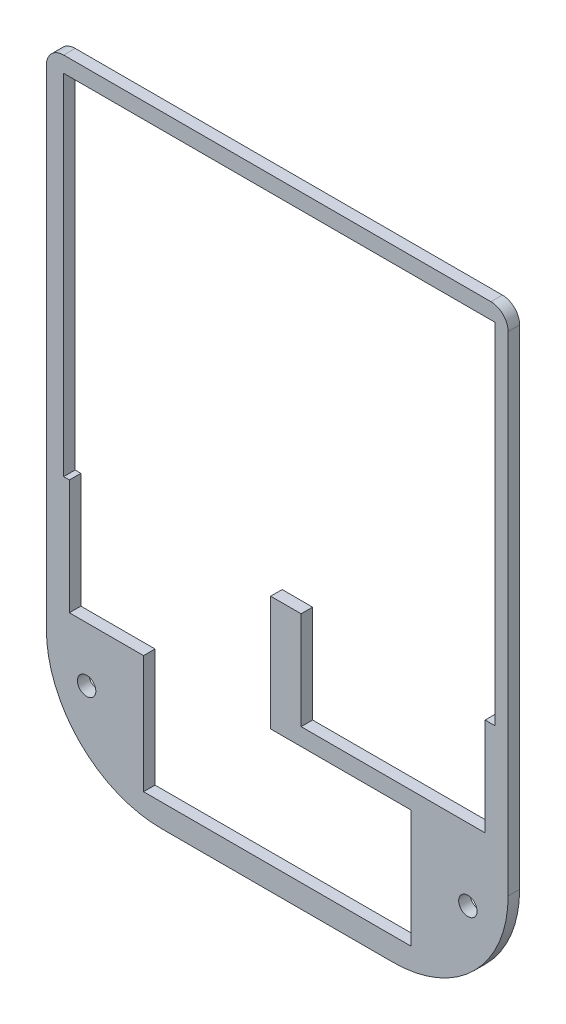
ISO-10303-21;
HEADER;
FILE_DESCRIPTION(('STEP AP214'),'2;1');
FILE_NAME('part.step','',(''),(''),'','','');
FILE_SCHEMA(('AUTOMOTIVE_DESIGN { 1 0 10303 214 1 1 1 1 }'));
ENDSEC;
DATA;
#1=APPLICATION_CONTEXT('core data for automotive mechanical design processes');
#2=APPLICATION_PROTOCOL_DEFINITION('international standard','automotive_design',2000,#1);
#3=PRODUCT_CONTEXT('',#1,'mechanical');
#4=PRODUCT('Part','Part','',(#3));
#5=PRODUCT_RELATED_PRODUCT_CATEGORY('part','',(#4));
#6=PRODUCT_DEFINITION_FORMATION('','',#4);
#7=PRODUCT_DEFINITION_CONTEXT('part definition',#1,'design');
#8=PRODUCT_DEFINITION('design','',#6,#7);
#9=PRODUCT_DEFINITION_SHAPE('','',#8);
#10=(LENGTH_UNIT() NAMED_UNIT(*) SI_UNIT(.MILLI.,.METRE.));
#11=(NAMED_UNIT(*) PLANE_ANGLE_UNIT() SI_UNIT($,.RADIAN.));
#12=(NAMED_UNIT(*) SI_UNIT($,.STERADIAN.) SOLID_ANGLE_UNIT());
#13=UNCERTAINTY_MEASURE_WITH_UNIT(LENGTH_MEASURE(1.E-05),#10,'distance_accuracy_value','');
#14=(GEOMETRIC_REPRESENTATION_CONTEXT(3) GLOBAL_UNCERTAINTY_ASSIGNED_CONTEXT((#13)) GLOBAL_UNIT_ASSIGNED_CONTEXT((#10,
#11,#12)) REPRESENTATION_CONTEXT('',''));
#15=CARTESIAN_POINT('',(0.,0.,0.));
#16=DIRECTION('',(0.,0.,1.));
#17=DIRECTION('',(1.,0.,0.));
#18=AXIS2_PLACEMENT_3D('',#15,#16,#17);
#19=CARTESIAN_POINT('',(0.,0.,2.));
#20=DIRECTION('',(0.,0.,-1.));
#21=DIRECTION('',(-1.,0.,0.));
#22=AXIS2_PLACEMENT_3D('',#19,#20,#21);
#23=PLANE('',#22);
#24=CARTESIAN_POINT('',(7.,-27.,2.));
#25=DIRECTION('',(0.,0.,1.));
#26=DIRECTION('',(1.,0.,0.));
#27=AXIS2_PLACEMENT_3D('',#24,#25,#26);
#28=CIRCLE('',#27,1.59999999999999);
#29=CARTESIAN_POINT('',(8.59999999999999,-27.,2.));
#30=VERTEX_POINT('',#29);
#31=EDGE_CURVE('E376',#30,#30,#28,.T.);
#32=ORIENTED_EDGE('',*,*,#31,.F.);
#33=EDGE_LOOP('',(#32));
#34=FACE_BOUND('',#33,.T.);
#35=CARTESIAN_POINT('',(73.3,-27.,2.));
#36=DIRECTION('',(0.,0.,1.));
#37=DIRECTION('',(1.,0.,0.));
#38=AXIS2_PLACEMENT_3D('',#35,#36,#37);
#39=CIRCLE('',#38,1.59999999999999);
#40=CARTESIAN_POINT('',(74.9,-27.,2.));
#41=VERTEX_POINT('',#40);
#42=EDGE_CURVE('E380',#41,#41,#39,.T.);
#43=ORIENTED_EDGE('',*,*,#42,.F.);
#44=EDGE_LOOP('',(#43));
#45=FACE_BOUND('',#44,.T.);
#46=DIRECTION('',(0.,-1.,0.));
#47=VECTOR('',#46,1.);
#48=CARTESIAN_POINT('',(0.,0.,2.));
#49=LINE('',#48,#47);
#50=CARTESIAN_POINT('',(0.,63.,2.));
#51=VERTEX_POINT('',#50);
#52=CARTESIAN_POINT('',(0.,-22.,2.));
#53=VERTEX_POINT('',#52);
#54=EDGE_CURVE('E391',#51,#53,#49,.T.);
#55=ORIENTED_EDGE('',*,*,#54,.T.);
#56=CARTESIAN_POINT('',(20.,-22.,2.));
#57=DIRECTION('',(0.,0.,-1.));
#58=DIRECTION('',(-1.,0.,0.));
#59=AXIS2_PLACEMENT_3D('',#56,#57,#58);
#60=CIRCLE('',#59,20.);
#61=CARTESIAN_POINT('',(20.,-42.,2.));
#62=VERTEX_POINT('',#61);
#63=EDGE_CURVE('E78',#53,#62,#60,.F.);
#64=ORIENTED_EDGE('',*,*,#63,.T.);
#65=DIRECTION('',(-1.,0.,0.));
#66=VECTOR('',#65,1.);
#67=CARTESIAN_POINT('',(80.3,-42.,2.));
#68=LINE('',#67,#66);
#69=CARTESIAN_POINT('',(60.3,-42.,2.));
#70=VERTEX_POINT('',#69);
#71=EDGE_CURVE('E387',#70,#62,#68,.T.);
#72=ORIENTED_EDGE('',*,*,#71,.F.);
#73=CARTESIAN_POINT('',(60.3,-22.,2.));
#74=DIRECTION('',(0.,0.,-1.));
#75=DIRECTION('',(-1.,0.,0.));
#76=AXIS2_PLACEMENT_3D('',#73,#74,#75);
#77=CIRCLE('',#76,20.);
#78=CARTESIAN_POINT('',(80.3,-22.,2.));
#79=VERTEX_POINT('',#78);
#80=EDGE_CURVE('E86',#70,#79,#77,.F.);
#81=ORIENTED_EDGE('',*,*,#80,.T.);
#82=DIRECTION('',(0.,1.,0.));
#83=VECTOR('',#82,1.);
#84=CARTESIAN_POINT('',(80.3,0.,2.));
#85=LINE('',#84,#83);
#86=CARTESIAN_POINT('',(80.3,63.,2.));
#87=VERTEX_POINT('',#86);
#88=EDGE_CURVE('E393',#79,#87,#85,.T.);
#89=ORIENTED_EDGE('',*,*,#88,.T.);
#90=CARTESIAN_POINT('',(77.3,63.,2.));
#91=DIRECTION('',(0.,0.,-1.));
#92=DIRECTION('',(-1.,0.,0.));
#93=AXIS2_PLACEMENT_3D('',#90,#91,#92);
#94=CIRCLE('',#93,3.);
#95=CARTESIAN_POINT('',(77.3,66.,2.));
#96=VERTEX_POINT('',#95);
#97=EDGE_CURVE('E419',#87,#96,#94,.F.);
#98=ORIENTED_EDGE('',*,*,#97,.T.);
#99=DIRECTION('',(-1.,0.,0.));
#100=VECTOR('',#99,1.);
#101=CARTESIAN_POINT('',(0.,66.,2.));
#102=LINE('',#101,#100);
#103=CARTESIAN_POINT('',(3.,66.,2.));
#104=VERTEX_POINT('',#103);
#105=EDGE_CURVE('E396',#96,#104,#102,.T.);
#106=ORIENTED_EDGE('',*,*,#105,.T.);
#107=CARTESIAN_POINT('',(3.,63.,2.));
#108=DIRECTION('',(0.,0.,-1.));
#109=DIRECTION('',(-1.,0.,0.));
#110=AXIS2_PLACEMENT_3D('',#107,#108,#109);
#111=CIRCLE('',#110,3.);
#112=EDGE_CURVE('E417',#104,#51,#111,.F.);
#113=ORIENTED_EDGE('',*,*,#112,.T.);
#114=EDGE_LOOP('',(#55,#64,#72,#81,#89,#98,#106,#113));
#115=FACE_BOUND('',#114,.T.);
#116=DIRECTION('',(0.,1.,0.));
#117=VECTOR('',#116,1.);
#118=CARTESIAN_POINT('',(78.,63.25,2.));
#119=LINE('',#118,#117);
#120=CARTESIAN_POINT('',(78.,2.50000000000001,2.));
#121=VERTEX_POINT('',#120);
#122=CARTESIAN_POINT('',(78.,63.25,2.));
#123=VERTEX_POINT('',#122);
#124=EDGE_CURVE('E286',#121,#123,#119,.T.);
#125=ORIENTED_EDGE('',*,*,#124,.F.);
#126=DIRECTION('',(1.,0.,0.));
#127=VECTOR('',#126,1.);
#128=CARTESIAN_POINT('',(3.00000000000001,2.50000000000001,2.));
#129=LINE('',#128,#127);
#130=CARTESIAN_POINT('',(76.3,2.50000000000001,2.));
#131=VERTEX_POINT('',#130);
#132=EDGE_CURVE('E270',#131,#121,#129,.T.);
#133=ORIENTED_EDGE('',*,*,#132,.F.);
#134=DIRECTION('',(0.,-1.,0.));
#135=VECTOR('',#134,1.);
#136=CARTESIAN_POINT('',(76.3,0.,2.));
#137=LINE('',#136,#135);
#138=CARTESIAN_POINT('',(76.3,-14.5,2.));
#139=VERTEX_POINT('',#138);
#140=EDGE_CURVE('E288',#131,#139,#137,.T.);
#141=ORIENTED_EDGE('',*,*,#140,.T.);
#142=DIRECTION('',(1.,0.,0.));
#143=VECTOR('',#142,1.);
#144=CARTESIAN_POINT('',(0.,-14.5,2.));
#145=LINE('',#144,#143);
#146=CARTESIAN_POINT('',(44.3,-14.5,2.));
#147=VERTEX_POINT('',#146);
#148=EDGE_CURVE('E295',#147,#139,#145,.T.);
#149=ORIENTED_EDGE('',*,*,#148,.F.);
#150=DIRECTION('',(0.,-1.,0.));
#151=VECTOR('',#150,1.);
#152=CARTESIAN_POINT('',(44.3,0.,2.));
#153=LINE('',#152,#151);
#154=CARTESIAN_POINT('',(44.3,2.5,2.));
#155=VERTEX_POINT('',#154);
#156=EDGE_CURVE('E289',#155,#147,#153,.T.);
#157=ORIENTED_EDGE('',*,*,#156,.F.);
#158=CARTESIAN_POINT('',(39.,2.50000000000001,2.));
#159=VERTEX_POINT('',#158);
#160=EDGE_CURVE('E269',#159,#155,#129,.T.);
#161=ORIENTED_EDGE('',*,*,#160,.F.);
#162=DIRECTION('',(0.,-1.,0.));
#163=VECTOR('',#162,1.);
#164=CARTESIAN_POINT('',(39.,0.,2.));
#165=LINE('',#164,#163);
#166=CARTESIAN_POINT('',(39.,-17.5,2.));
#167=VERTEX_POINT('',#166);
#168=EDGE_CURVE('E307',#159,#167,#165,.T.);
#169=ORIENTED_EDGE('',*,*,#168,.T.);
#170=DIRECTION('',(1.,0.,0.));
#171=VECTOR('',#170,1.);
#172=CARTESIAN_POINT('',(0.,-17.5,2.));
#173=LINE('',#172,#171);
#174=CARTESIAN_POINT('',(63.4,-17.5,2.));
#175=VERTEX_POINT('',#174);
#176=EDGE_CURVE('E317',#167,#175,#173,.T.);
#177=ORIENTED_EDGE('',*,*,#176,.T.);
#178=DIRECTION('',(0.,-1.,0.));
#179=VECTOR('',#178,1.);
#180=CARTESIAN_POINT('',(63.4,0.,2.));
#181=LINE('',#180,#179);
#182=CARTESIAN_POINT('',(63.4,-38.,2.));
#183=VERTEX_POINT('',#182);
#184=EDGE_CURVE('E347',#175,#183,#181,.T.);
#185=ORIENTED_EDGE('',*,*,#184,.T.);
#186=DIRECTION('',(1.,0.,0.));
#187=VECTOR('',#186,1.);
#188=CARTESIAN_POINT('',(0.,-38.,2.));
#189=LINE('',#188,#187);
#190=CARTESIAN_POINT('',(16.9,-38.,2.));
#191=VERTEX_POINT('',#190);
#192=EDGE_CURVE('E344',#191,#183,#189,.T.);
#193=ORIENTED_EDGE('',*,*,#192,.F.);
#194=DIRECTION('',(0.,-1.,0.));
#195=VECTOR('',#194,1.);
#196=CARTESIAN_POINT('',(16.9,0.,2.));
#197=LINE('',#196,#195);
#198=CARTESIAN_POINT('',(16.9,-17.5,2.));
#199=VERTEX_POINT('',#198);
#200=EDGE_CURVE('E341',#199,#191,#197,.T.);
#201=ORIENTED_EDGE('',*,*,#200,.F.);
#202=DIRECTION('',(1.,0.,0.));
#203=VECTOR('',#202,1.);
#204=CARTESIAN_POINT('',(0.,-17.5,2.));
#205=LINE('',#204,#203);
#206=CARTESIAN_POINT('',(4.,-17.5,2.));
#207=VERTEX_POINT('',#206);
#208=EDGE_CURVE('E338',#207,#199,#205,.T.);
#209=ORIENTED_EDGE('',*,*,#208,.F.);
#210=DIRECTION('',(0.,-1.,0.));
#211=VECTOR('',#210,1.);
#212=CARTESIAN_POINT('',(4.,0.,2.));
#213=LINE('',#212,#211);
#214=CARTESIAN_POINT('',(4.,2.5,2.));
#215=VERTEX_POINT('',#214);
#216=EDGE_CURVE('E335',#215,#207,#213,.T.);
#217=ORIENTED_EDGE('',*,*,#216,.F.);
#218=CARTESIAN_POINT('',(3.00000000000001,2.50000000000001,2.));
#219=VERTEX_POINT('',#218);
#220=EDGE_CURVE('E267',#219,#215,#129,.T.);
#221=ORIENTED_EDGE('',*,*,#220,.F.);
#222=DIRECTION('',(0.,-1.,0.));
#223=VECTOR('',#222,1.);
#224=CARTESIAN_POINT('',(3.00000000000001,63.25,2.));
#225=LINE('',#224,#223);
#226=CARTESIAN_POINT('',(3.00000000000001,63.25,2.));
#227=VERTEX_POINT('',#226);
#228=EDGE_CURVE('E254',#227,#219,#225,.T.);
#229=ORIENTED_EDGE('',*,*,#228,.F.);
#230=DIRECTION('',(-1.,0.,0.));
#231=VECTOR('',#230,1.);
#232=CARTESIAN_POINT('',(3.00000000000001,63.25,2.));
#233=LINE('',#232,#231);
#234=EDGE_CURVE('E248',#123,#227,#233,.T.);
#235=ORIENTED_EDGE('',*,*,#234,.F.);
#236=EDGE_LOOP('',(#125,#133,#141,#149,#157,#161,#169,#177,#185,#193,#201,#209,#217,#221,#229,#235));
#237=FACE_BOUND('',#236,.T.);
#238=ADVANCED_FACE('F69',(#34,#45,#115,#237),#23,.F.);
#239=CARTESIAN_POINT('',(0.,0.,0.));
#240=DIRECTION('',(0.,0.,-1.));
#241=DIRECTION('',(-1.,0.,0.));
#242=AXIS2_PLACEMENT_3D('',#239,#240,#241);
#243=PLANE('',#242);
#244=DIRECTION('',(1.,0.,0.));
#245=VECTOR('',#244,1.);
#246=CARTESIAN_POINT('',(3.00000000000001,2.50000000000001,0.));
#247=LINE('',#246,#245);
#248=CARTESIAN_POINT('',(76.3,2.50000000000001,0.));
#249=VERTEX_POINT('',#248);
#250=CARTESIAN_POINT('',(78.,2.50000000000001,0.));
#251=VERTEX_POINT('',#250);
#252=EDGE_CURVE('E264',#249,#251,#247,.T.);
#253=ORIENTED_EDGE('',*,*,#252,.T.);
#254=DIRECTION('',(0.,1.,0.));
#255=VECTOR('',#254,1.);
#256=CARTESIAN_POINT('',(78.,63.25,0.));
#257=LINE('',#256,#255);
#258=CARTESIAN_POINT('',(78.,63.25,0.));
#259=VERTEX_POINT('',#258);
#260=EDGE_CURVE('E247',#251,#259,#257,.T.);
#261=ORIENTED_EDGE('',*,*,#260,.T.);
#262=DIRECTION('',(-1.,0.,0.));
#263=VECTOR('',#262,1.);
#264=CARTESIAN_POINT('',(3.00000000000001,63.25,0.));
#265=LINE('',#264,#263);
#266=CARTESIAN_POINT('',(3.00000000000001,63.25,0.));
#267=VERTEX_POINT('',#266);
#268=EDGE_CURVE('E245',#259,#267,#265,.T.);
#269=ORIENTED_EDGE('',*,*,#268,.T.);
#270=DIRECTION('',(0.,-1.,0.));
#271=VECTOR('',#270,1.);
#272=CARTESIAN_POINT('',(3.00000000000001,63.25,0.));
#273=LINE('',#272,#271);
#274=CARTESIAN_POINT('',(3.00000000000001,2.50000000000001,0.));
#275=VERTEX_POINT('',#274);
#276=EDGE_CURVE('E234',#267,#275,#273,.T.);
#277=ORIENTED_EDGE('',*,*,#276,.T.);
#278=CARTESIAN_POINT('',(4.,2.50000000000001,0.));
#279=VERTEX_POINT('',#278);
#280=EDGE_CURVE('E241',#275,#279,#247,.T.);
#281=ORIENTED_EDGE('',*,*,#280,.T.);
#282=DIRECTION('',(0.,-1.,0.));
#283=VECTOR('',#282,1.);
#284=CARTESIAN_POINT('',(4.,0.,0.));
#285=LINE('',#284,#283);
#286=CARTESIAN_POINT('',(4.,-17.5,0.));
#287=VERTEX_POINT('',#286);
#288=EDGE_CURVE('E316',#279,#287,#285,.T.);
#289=ORIENTED_EDGE('',*,*,#288,.T.);
#290=DIRECTION('',(1.,0.,0.));
#291=VECTOR('',#290,1.);
#292=CARTESIAN_POINT('',(0.,-17.5,0.));
#293=LINE('',#292,#291);
#294=CARTESIAN_POINT('',(16.9,-17.5,0.));
#295=VERTEX_POINT('',#294);
#296=EDGE_CURVE('E319',#287,#295,#293,.T.);
#297=ORIENTED_EDGE('',*,*,#296,.T.);
#298=DIRECTION('',(0.,-1.,0.));
#299=VECTOR('',#298,1.);
#300=CARTESIAN_POINT('',(16.9,0.,0.));
#301=LINE('',#300,#299);
#302=CARTESIAN_POINT('',(16.9,-38.,0.));
#303=VERTEX_POINT('',#302);
#304=EDGE_CURVE('E322',#295,#303,#301,.T.);
#305=ORIENTED_EDGE('',*,*,#304,.T.);
#306=DIRECTION('',(1.,0.,0.));
#307=VECTOR('',#306,1.);
#308=CARTESIAN_POINT('',(0.,-38.,0.));
#309=LINE('',#308,#307);
#310=CARTESIAN_POINT('',(63.4,-38.,0.));
#311=VERTEX_POINT('',#310);
#312=EDGE_CURVE('E325',#303,#311,#309,.T.);
#313=ORIENTED_EDGE('',*,*,#312,.T.);
#314=DIRECTION('',(0.,-1.,0.));
#315=VECTOR('',#314,1.);
#316=CARTESIAN_POINT('',(63.4,0.,0.));
#317=LINE('',#316,#315);
#318=CARTESIAN_POINT('',(63.4,-17.5,0.));
#319=VERTEX_POINT('',#318);
#320=EDGE_CURVE('E328',#319,#311,#317,.T.);
#321=ORIENTED_EDGE('',*,*,#320,.F.);
#322=DIRECTION('',(1.,0.,0.));
#323=VECTOR('',#322,1.);
#324=CARTESIAN_POINT('',(0.,-17.5,0.));
#325=LINE('',#324,#323);
#326=CARTESIAN_POINT('',(39.,-17.5,0.));
#327=VERTEX_POINT('',#326);
#328=EDGE_CURVE('E330',#327,#319,#325,.T.);
#329=ORIENTED_EDGE('',*,*,#328,.F.);
#330=DIRECTION('',(0.,-1.,0.));
#331=VECTOR('',#330,1.);
#332=CARTESIAN_POINT('',(39.,0.,0.));
#333=LINE('',#332,#331);
#334=CARTESIAN_POINT('',(39.,2.50000000000001,0.));
#335=VERTEX_POINT('',#334);
#336=EDGE_CURVE('E314',#335,#327,#333,.T.);
#337=ORIENTED_EDGE('',*,*,#336,.F.);
#338=CARTESIAN_POINT('',(44.3,2.50000000000001,0.));
#339=VERTEX_POINT('',#338);
#340=EDGE_CURVE('E262',#335,#339,#247,.T.);
#341=ORIENTED_EDGE('',*,*,#340,.T.);
#342=DIRECTION('',(0.,-1.,0.));
#343=VECTOR('',#342,1.);
#344=CARTESIAN_POINT('',(44.3,0.,0.));
#345=LINE('',#344,#343);
#346=CARTESIAN_POINT('',(44.3,-14.5,0.));
#347=VERTEX_POINT('',#346);
#348=EDGE_CURVE('E294',#339,#347,#345,.T.);
#349=ORIENTED_EDGE('',*,*,#348,.T.);
#350=DIRECTION('',(1.,0.,0.));
#351=VECTOR('',#350,1.);
#352=CARTESIAN_POINT('',(0.,-14.5,0.));
#353=LINE('',#352,#351);
#354=CARTESIAN_POINT('',(76.3,-14.5,0.));
#355=VERTEX_POINT('',#354);
#356=EDGE_CURVE('E298',#347,#355,#353,.T.);
#357=ORIENTED_EDGE('',*,*,#356,.T.);
#358=DIRECTION('',(0.,-1.,0.));
#359=VECTOR('',#358,1.);
#360=CARTESIAN_POINT('',(76.3,0.,0.));
#361=LINE('',#360,#359);
#362=EDGE_CURVE('E292',#249,#355,#361,.T.);
#363=ORIENTED_EDGE('',*,*,#362,.F.);
#364=EDGE_LOOP('',(#253,#261,#269,#277,#281,#289,#297,#305,#313,#321,#329,#337,#341,#349,#357,#363));
#365=FACE_BOUND('',#364,.T.);
#366=CARTESIAN_POINT('',(7.,-27.,0.));
#367=DIRECTION('',(0.,0.,-1.));
#368=DIRECTION('',(-1.,0.,0.));
#369=AXIS2_PLACEMENT_3D('',#366,#367,#368);
#370=CIRCLE('',#369,1.59999999999999);
#371=CARTESIAN_POINT('',(5.40000000000002,-27.,0.));
#372=VERTEX_POINT('',#371);
#373=EDGE_CURVE('E73',#372,#372,#370,.T.);
#374=ORIENTED_EDGE('',*,*,#373,.F.);
#375=EDGE_LOOP('',(#374));
#376=FACE_BOUND('',#375,.T.);
#377=CARTESIAN_POINT('',(73.3,-27.,0.));
#378=DIRECTION('',(0.,0.,-1.));
#379=DIRECTION('',(-1.,0.,0.));
#380=AXIS2_PLACEMENT_3D('',#377,#378,#379);
#381=CIRCLE('',#380,1.59999999999998);
#382=CARTESIAN_POINT('',(71.7,-27.,0.));
#383=VERTEX_POINT('',#382);
#384=EDGE_CURVE('E383',#383,#383,#381,.T.);
#385=ORIENTED_EDGE('',*,*,#384,.F.);
#386=EDGE_LOOP('',(#385));
#387=FACE_BOUND('',#386,.T.);
#388=DIRECTION('',(1.,0.,0.));
#389=VECTOR('',#388,1.);
#390=CARTESIAN_POINT('',(0.,-42.,0.));
#391=LINE('',#390,#389);
#392=CARTESIAN_POINT('',(20.,-42.,0.));
#393=VERTEX_POINT('',#392);
#394=CARTESIAN_POINT('',(60.3,-42.,0.));
#395=VERTEX_POINT('',#394);
#396=EDGE_CURVE('E384',#393,#395,#391,.T.);
#397=ORIENTED_EDGE('',*,*,#396,.F.);
#398=CARTESIAN_POINT('',(20.,-22.,0.));
#399=DIRECTION('',(0.,0.,-1.));
#400=DIRECTION('',(-1.,0.,0.));
#401=AXIS2_PLACEMENT_3D('',#398,#399,#400);
#402=CIRCLE('',#401,20.);
#403=CARTESIAN_POINT('',(0.,-22.,0.));
#404=VERTEX_POINT('',#403);
#405=EDGE_CURVE('E432',#393,#404,#402,.T.);
#406=ORIENTED_EDGE('',*,*,#405,.T.);
#407=DIRECTION('',(0.,-1.,0.));
#408=VECTOR('',#407,1.);
#409=CARTESIAN_POINT('',(0.,0.,0.));
#410=LINE('',#409,#408);
#411=CARTESIAN_POINT('',(0.,63.,0.));
#412=VERTEX_POINT('',#411);
#413=EDGE_CURVE('E390',#412,#404,#410,.T.);
#414=ORIENTED_EDGE('',*,*,#413,.F.);
#415=CARTESIAN_POINT('',(3.,63.,0.));
#416=DIRECTION('',(0.,0.,-1.));
#417=DIRECTION('',(-1.,0.,0.));
#418=AXIS2_PLACEMENT_3D('',#415,#416,#417);
#419=CIRCLE('',#418,3.);
#420=CARTESIAN_POINT('',(3.,66.,0.));
#421=VERTEX_POINT('',#420);
#422=EDGE_CURVE('E409',#412,#421,#419,.T.);
#423=ORIENTED_EDGE('',*,*,#422,.T.);
#424=DIRECTION('',(-1.,0.,0.));
#425=VECTOR('',#424,1.);
#426=CARTESIAN_POINT('',(0.,66.,0.));
#427=LINE('',#426,#425);
#428=CARTESIAN_POINT('',(77.3,66.,0.));
#429=VERTEX_POINT('',#428);
#430=EDGE_CURVE('E394',#429,#421,#427,.T.);
#431=ORIENTED_EDGE('',*,*,#430,.F.);
#432=CARTESIAN_POINT('',(77.3,63.,0.));
#433=DIRECTION('',(0.,0.,-1.));
#434=DIRECTION('',(-1.,0.,0.));
#435=AXIS2_PLACEMENT_3D('',#432,#433,#434);
#436=CIRCLE('',#435,3.);
#437=CARTESIAN_POINT('',(80.3,63.,0.));
#438=VERTEX_POINT('',#437);
#439=EDGE_CURVE('E411',#429,#438,#436,.T.);
#440=ORIENTED_EDGE('',*,*,#439,.T.);
#441=DIRECTION('',(0.,1.,0.));
#442=VECTOR('',#441,1.);
#443=CARTESIAN_POINT('',(80.3,0.,0.));
#444=LINE('',#443,#442);
#445=CARTESIAN_POINT('',(80.3,-22.,0.));
#446=VERTEX_POINT('',#445);
#447=EDGE_CURVE('E401',#446,#438,#444,.T.);
#448=ORIENTED_EDGE('',*,*,#447,.F.);
#449=CARTESIAN_POINT('',(60.3,-22.,0.));
#450=DIRECTION('',(0.,0.,-1.));
#451=DIRECTION('',(-1.,0.,0.));
#452=AXIS2_PLACEMENT_3D('',#449,#450,#451);
#453=CIRCLE('',#452,20.);
#454=EDGE_CURVE('E430',#446,#395,#453,.T.);
#455=ORIENTED_EDGE('',*,*,#454,.T.);
#456=EDGE_LOOP('',(#397,#406,#414,#423,#431,#440,#448,#455));
#457=FACE_BOUND('',#456,.T.);
#458=ADVANCED_FACE('F237',(#365,#376,#387,#457),#243,.T.);
#459=CARTESIAN_POINT('',(0.,0.,2.));
#460=DIRECTION('',(1.,0.,0.));
#461=DIRECTION('',(0.,0.,-1.));
#462=AXIS2_PLACEMENT_3D('',#459,#460,#461);
#463=PLANE('',#462);
#464=ORIENTED_EDGE('',*,*,#413,.T.);
#465=DIRECTION('',(0.,0.,-1.));
#466=VECTOR('',#465,1.);
#467=CARTESIAN_POINT('',(0.,-22.,2.));
#468=LINE('',#467,#466);
#469=EDGE_CURVE('E94',#404,#53,#468,.F.);
#470=ORIENTED_EDGE('',*,*,#469,.T.);
#471=ORIENTED_EDGE('',*,*,#54,.F.);
#472=DIRECTION('',(0.,0.,-1.));
#473=VECTOR('',#472,1.);
#474=CARTESIAN_POINT('',(0.,63.,2.));
#475=LINE('',#474,#473);
#476=EDGE_CURVE('E421',#51,#412,#475,.T.);
#477=ORIENTED_EDGE('',*,*,#476,.T.);
#478=EDGE_LOOP('',(#464,#470,#471,#477));
#479=FACE_BOUND('',#478,.T.);
#480=ADVANCED_FACE('F444',(#479),#463,.F.);
#481=CARTESIAN_POINT('',(80.3,0.,2.));
#482=DIRECTION('',(-1.,0.,0.));
#483=DIRECTION('',(0.,0.,1.));
#484=AXIS2_PLACEMENT_3D('',#481,#482,#483);
#485=PLANE('',#484);
#486=ORIENTED_EDGE('',*,*,#88,.F.);
#487=DIRECTION('',(0.,0.,1.));
#488=VECTOR('',#487,1.);
#489=CARTESIAN_POINT('',(80.3,-22.,0.));
#490=LINE('',#489,#488);
#491=EDGE_CURVE('E12',#79,#446,#490,.F.);
#492=ORIENTED_EDGE('',*,*,#491,.T.);
#493=ORIENTED_EDGE('',*,*,#447,.T.);
#494=DIRECTION('',(0.,0.,-1.));
#495=VECTOR('',#494,1.);
#496=CARTESIAN_POINT('',(80.3,63.,2.));
#497=LINE('',#496,#495);
#498=EDGE_CURVE('E414',#438,#87,#497,.F.);
#499=ORIENTED_EDGE('',*,*,#498,.T.);
#500=EDGE_LOOP('',(#486,#492,#493,#499));
#501=FACE_BOUND('',#500,.T.);
#502=ADVANCED_FACE('F457',(#501),#485,.F.);
#503=CARTESIAN_POINT('',(0.,66.,2.));
#504=DIRECTION('',(0.,-1.,0.));
#505=DIRECTION('',(0.,0.,-1.));
#506=AXIS2_PLACEMENT_3D('',#503,#504,#505);
#507=PLANE('',#506);
#508=ORIENTED_EDGE('',*,*,#105,.F.);
#509=DIRECTION('',(0.,0.,-1.));
#510=VECTOR('',#509,1.);
#511=CARTESIAN_POINT('',(77.3,66.,2.));
#512=LINE('',#511,#510);
#513=EDGE_CURVE('E406',#96,#429,#512,.T.);
#514=ORIENTED_EDGE('',*,*,#513,.T.);
#515=ORIENTED_EDGE('',*,*,#430,.T.);
#516=DIRECTION('',(0.,0.,-1.));
#517=VECTOR('',#516,1.);
#518=CARTESIAN_POINT('',(3.,66.,2.));
#519=LINE('',#518,#517);
#520=EDGE_CURVE('E399',#421,#104,#519,.F.);
#521=ORIENTED_EDGE('',*,*,#520,.T.);
#522=EDGE_LOOP('',(#508,#514,#515,#521));
#523=FACE_BOUND('',#522,.T.);
#524=ADVANCED_FACE('F467',(#523),#507,.F.);
#525=CARTESIAN_POINT('',(77.3,63.,2.));
#526=DIRECTION('',(0.,0.,-1.));
#527=DIRECTION('',(-1.,0.,0.));
#528=AXIS2_PLACEMENT_3D('',#525,#526,#527);
#529=CYLINDRICAL_SURFACE('',#528,3.);
#530=ORIENTED_EDGE('',*,*,#97,.F.);
#531=ORIENTED_EDGE('',*,*,#498,.F.);
#532=ORIENTED_EDGE('',*,*,#439,.F.);
#533=ORIENTED_EDGE('',*,*,#513,.F.);
#534=EDGE_LOOP('',(#530,#531,#532,#533));
#535=FACE_BOUND('',#534,.T.);
#536=ADVANCED_FACE('F463',(#535),#529,.T.);
#537=CARTESIAN_POINT('',(3.,63.,2.));
#538=DIRECTION('',(0.,0.,-1.));
#539=DIRECTION('',(-1.,0.,0.));
#540=AXIS2_PLACEMENT_3D('',#537,#538,#539);
#541=CYLINDRICAL_SURFACE('',#540,3.);
#542=ORIENTED_EDGE('',*,*,#112,.F.);
#543=ORIENTED_EDGE('',*,*,#520,.F.);
#544=ORIENTED_EDGE('',*,*,#422,.F.);
#545=ORIENTED_EDGE('',*,*,#476,.F.);
#546=EDGE_LOOP('',(#542,#543,#544,#545));
#547=FACE_BOUND('',#546,.T.);
#548=ADVANCED_FACE('F470',(#547),#541,.T.);
#549=CARTESIAN_POINT('',(0.,-42.,0.));
#550=DIRECTION('',(0.,-1.,0.));
#551=DIRECTION('',(0.,0.,-1.));
#552=AXIS2_PLACEMENT_3D('',#549,#550,#551);
#553=PLANE('',#552);
#554=ORIENTED_EDGE('',*,*,#71,.T.);
#555=DIRECTION('',(0.,0.,-1.));
#556=VECTOR('',#555,1.);
#557=CARTESIAN_POINT('',(20.,-42.,0.));
#558=LINE('',#557,#556);
#559=EDGE_CURVE('E427',#62,#393,#558,.T.);
#560=ORIENTED_EDGE('',*,*,#559,.T.);
#561=ORIENTED_EDGE('',*,*,#396,.T.);
#562=DIRECTION('',(0.,0.,1.));
#563=VECTOR('',#562,1.);
#564=CARTESIAN_POINT('',(60.3,-42.,2.));
#565=LINE('',#564,#563);
#566=EDGE_CURVE('E424',#395,#70,#565,.T.);
#567=ORIENTED_EDGE('',*,*,#566,.T.);
#568=EDGE_LOOP('',(#554,#560,#561,#567));
#569=FACE_BOUND('',#568,.T.);
#570=ADVANCED_FACE('F452',(#569),#553,.T.);
#571=CARTESIAN_POINT('',(20.,-22.,0.));
#572=DIRECTION('',(0.,0.,1.));
#573=DIRECTION('',(1.,0.,0.));
#574=AXIS2_PLACEMENT_3D('',#571,#572,#573);
#575=CYLINDRICAL_SURFACE('',#574,20.);
#576=ORIENTED_EDGE('',*,*,#63,.F.);
#577=ORIENTED_EDGE('',*,*,#469,.F.);
#578=ORIENTED_EDGE('',*,*,#405,.F.);
#579=ORIENTED_EDGE('',*,*,#559,.F.);
#580=EDGE_LOOP('',(#576,#577,#578,#579));
#581=FACE_BOUND('',#580,.T.);
#582=ADVANCED_FACE('F474',(#581),#575,.T.);
#583=CARTESIAN_POINT('',(60.3,-22.,0.));
#584=DIRECTION('',(0.,0.,-1.));
#585=DIRECTION('',(-1.,0.,0.));
#586=AXIS2_PLACEMENT_3D('',#583,#584,#585);
#587=CYLINDRICAL_SURFACE('',#586,20.);
#588=ORIENTED_EDGE('',*,*,#454,.F.);
#589=ORIENTED_EDGE('',*,*,#491,.F.);
#590=ORIENTED_EDGE('',*,*,#80,.F.);
#591=ORIENTED_EDGE('',*,*,#566,.F.);
#592=EDGE_LOOP('',(#588,#589,#590,#591));
#593=FACE_BOUND('',#592,.T.);
#594=ADVANCED_FACE('F71',(#593),#587,.T.);
#595=CARTESIAN_POINT('',(73.3,-27.,2.));
#596=DIRECTION('',(0.,0.,1.));
#597=DIRECTION('',(1.,0.,0.));
#598=AXIS2_PLACEMENT_3D('',#595,#596,#597);
#599=CYLINDRICAL_SURFACE('',#598,1.59999999999998);
#600=ORIENTED_EDGE('',*,*,#384,.T.);
#601=EDGE_LOOP('',(#600));
#602=FACE_BOUND('',#601,.T.);
#603=ORIENTED_EDGE('',*,*,#42,.T.);
#604=EDGE_LOOP('',(#603));
#605=FACE_BOUND('',#604,.T.);
#606=ADVANCED_FACE('F439',(#602,#605),#599,.F.);
#607=CARTESIAN_POINT('',(7.,-27.,2.));
#608=DIRECTION('',(0.,0.,1.));
#609=DIRECTION('',(1.,0.,0.));
#610=AXIS2_PLACEMENT_3D('',#607,#608,#609);
#611=CYLINDRICAL_SURFACE('',#610,1.59999999999999);
#612=ORIENTED_EDGE('',*,*,#373,.T.);
#613=EDGE_LOOP('',(#612));
#614=FACE_BOUND('',#613,.T.);
#615=ORIENTED_EDGE('',*,*,#31,.T.);
#616=EDGE_LOOP('',(#615));
#617=FACE_BOUND('',#616,.T.);
#618=ADVANCED_FACE('F530',(#614,#617),#611,.F.);
#619=CARTESIAN_POINT('',(3.00000000000001,63.25,0.));
#620=DIRECTION('',(-1.,0.,0.));
#621=DIRECTION('',(0.,0.,1.));
#622=AXIS2_PLACEMENT_3D('',#619,#620,#621);
#623=PLANE('',#622);
#624=ORIENTED_EDGE('',*,*,#228,.T.);
#625=DIRECTION('',(0.,0.,1.));
#626=VECTOR('',#625,1.);
#627=CARTESIAN_POINT('',(3.00000000000001,2.50000000000001,0.));
#628=LINE('',#627,#626);
#629=EDGE_CURVE('E251',#275,#219,#628,.T.);
#630=ORIENTED_EDGE('',*,*,#629,.F.);
#631=ORIENTED_EDGE('',*,*,#276,.F.);
#632=DIRECTION('',(0.,0.,1.));
#633=VECTOR('',#632,1.);
#634=CARTESIAN_POINT('',(3.00000000000001,63.25,0.));
#635=LINE('',#634,#633);
#636=EDGE_CURVE('E374',#267,#227,#635,.T.);
#637=ORIENTED_EDGE('',*,*,#636,.T.);
#638=EDGE_LOOP('',(#624,#630,#631,#637));
#639=FACE_BOUND('',#638,.T.);
#640=ADVANCED_FACE('F252',(#639),#623,.F.);
#641=CARTESIAN_POINT('',(3.00000000000001,63.25,0.));
#642=DIRECTION('',(0.,1.,0.));
#643=DIRECTION('',(0.,0.,1.));
#644=AXIS2_PLACEMENT_3D('',#641,#642,#643);
#645=PLANE('',#644);
#646=ORIENTED_EDGE('',*,*,#234,.T.);
#647=ORIENTED_EDGE('',*,*,#636,.F.);
#648=ORIENTED_EDGE('',*,*,#268,.F.);
#649=DIRECTION('',(0.,0.,1.));
#650=VECTOR('',#649,1.);
#651=CARTESIAN_POINT('',(78.,63.25,0.));
#652=LINE('',#651,#650);
#653=EDGE_CURVE('E369',#259,#123,#652,.T.);
#654=ORIENTED_EDGE('',*,*,#653,.T.);
#655=EDGE_LOOP('',(#646,#647,#648,#654));
#656=FACE_BOUND('',#655,.T.);
#657=ADVANCED_FACE('F545',(#656),#645,.F.);
#658=CARTESIAN_POINT('',(78.,63.25,0.));
#659=DIRECTION('',(1.,0.,0.));
#660=DIRECTION('',(0.,0.,-1.));
#661=AXIS2_PLACEMENT_3D('',#658,#659,#660);
#662=PLANE('',#661);
#663=ORIENTED_EDGE('',*,*,#124,.T.);
#664=ORIENTED_EDGE('',*,*,#653,.F.);
#665=ORIENTED_EDGE('',*,*,#260,.F.);
#666=DIRECTION('',(0.,0.,1.));
#667=VECTOR('',#666,1.);
#668=CARTESIAN_POINT('',(78.,2.50000000000001,0.));
#669=LINE('',#668,#667);
#670=EDGE_CURVE('E257',#251,#121,#669,.T.);
#671=ORIENTED_EDGE('',*,*,#670,.T.);
#672=EDGE_LOOP('',(#663,#664,#665,#671));
#673=FACE_BOUND('',#672,.T.);
#674=ADVANCED_FACE('F285',(#673),#662,.F.);
#675=CARTESIAN_POINT('',(39.,0.,0.));
#676=DIRECTION('',(-1.,0.,0.));
#677=DIRECTION('',(0.,0.,1.));
#678=AXIS2_PLACEMENT_3D('',#675,#676,#677);
#679=PLANE('',#678);
#680=ORIENTED_EDGE('',*,*,#168,.F.);
#681=DIRECTION('',(0.,0.,1.));
#682=VECTOR('',#681,1.);
#683=CARTESIAN_POINT('',(39.,2.5,0.));
#684=LINE('',#683,#682);
#685=EDGE_CURVE('E332',#335,#159,#684,.T.);
#686=ORIENTED_EDGE('',*,*,#685,.F.);
#687=ORIENTED_EDGE('',*,*,#336,.T.);
#688=DIRECTION('',(0.,0.,1.));
#689=VECTOR('',#688,1.);
#690=CARTESIAN_POINT('',(39.,-17.5,0.));
#691=LINE('',#690,#689);
#692=EDGE_CURVE('E352',#327,#167,#691,.T.);
#693=ORIENTED_EDGE('',*,*,#692,.T.);
#694=EDGE_LOOP('',(#680,#686,#687,#693));
#695=FACE_BOUND('',#694,.T.);
#696=ADVANCED_FACE('F563',(#695),#679,.T.);
#697=CARTESIAN_POINT('',(0.,-17.5,0.));
#698=DIRECTION('',(0.,-1.,0.));
#699=DIRECTION('',(1.,0.,0.));
#700=AXIS2_PLACEMENT_3D('',#697,#698,#699);
#701=PLANE('',#700);
#702=ORIENTED_EDGE('',*,*,#176,.F.);
#703=ORIENTED_EDGE('',*,*,#692,.F.);
#704=ORIENTED_EDGE('',*,*,#328,.T.);
#705=DIRECTION('',(0.,0.,1.));
#706=VECTOR('',#705,1.);
#707=CARTESIAN_POINT('',(63.4,-17.5,0.));
#708=LINE('',#707,#706);
#709=EDGE_CURVE('E355',#319,#175,#708,.T.);
#710=ORIENTED_EDGE('',*,*,#709,.T.);
#711=EDGE_LOOP('',(#702,#703,#704,#710));
#712=FACE_BOUND('',#711,.T.);
#713=ADVANCED_FACE('F557',(#712),#701,.T.);
#714=CARTESIAN_POINT('',(63.4,0.,0.));
#715=DIRECTION('',(-1.,0.,0.));
#716=DIRECTION('',(0.,0.,1.));
#717=AXIS2_PLACEMENT_3D('',#714,#715,#716);
#718=PLANE('',#717);
#719=ORIENTED_EDGE('',*,*,#184,.F.);
#720=ORIENTED_EDGE('',*,*,#709,.F.);
#721=ORIENTED_EDGE('',*,*,#320,.T.);
#722=DIRECTION('',(0.,0.,1.));
#723=VECTOR('',#722,1.);
#724=CARTESIAN_POINT('',(63.4,-38.,0.));
#725=LINE('',#724,#723);
#726=EDGE_CURVE('E357',#311,#183,#725,.T.);
#727=ORIENTED_EDGE('',*,*,#726,.T.);
#728=EDGE_LOOP('',(#719,#720,#721,#727));
#729=FACE_BOUND('',#728,.T.);
#730=ADVANCED_FACE('F562',(#729),#718,.T.);
#731=CARTESIAN_POINT('',(0.,-38.,0.));
#732=DIRECTION('',(0.,-1.,0.));
#733=DIRECTION('',(1.,0.,0.));
#734=AXIS2_PLACEMENT_3D('',#731,#732,#733);
#735=PLANE('',#734);
#736=ORIENTED_EDGE('',*,*,#192,.T.);
#737=ORIENTED_EDGE('',*,*,#726,.F.);
#738=ORIENTED_EDGE('',*,*,#312,.F.);
#739=DIRECTION('',(0.,0.,1.));
#740=VECTOR('',#739,1.);
#741=CARTESIAN_POINT('',(16.9,-38.,0.));
#742=LINE('',#741,#740);
#743=EDGE_CURVE('E359',#303,#191,#742,.T.);
#744=ORIENTED_EDGE('',*,*,#743,.T.);
#745=EDGE_LOOP('',(#736,#737,#738,#744));
#746=FACE_BOUND('',#745,.T.);
#747=ADVANCED_FACE('F575',(#746),#735,.F.);
#748=CARTESIAN_POINT('',(16.9,0.,0.));
#749=DIRECTION('',(-1.,0.,0.));
#750=DIRECTION('',(0.,0.,1.));
#751=AXIS2_PLACEMENT_3D('',#748,#749,#750);
#752=PLANE('',#751);
#753=ORIENTED_EDGE('',*,*,#200,.T.);
#754=ORIENTED_EDGE('',*,*,#743,.F.);
#755=ORIENTED_EDGE('',*,*,#304,.F.);
#756=DIRECTION('',(0.,0.,1.));
#757=VECTOR('',#756,1.);
#758=CARTESIAN_POINT('',(16.9,-17.5,0.));
#759=LINE('',#758,#757);
#760=EDGE_CURVE('E361',#295,#199,#759,.T.);
#761=ORIENTED_EDGE('',*,*,#760,.T.);
#762=EDGE_LOOP('',(#753,#754,#755,#761));
#763=FACE_BOUND('',#762,.T.);
#764=ADVANCED_FACE('F585',(#763),#752,.F.);
#765=CARTESIAN_POINT('',(0.,-17.5,0.));
#766=DIRECTION('',(0.,-1.,0.));
#767=DIRECTION('',(0.,0.,-1.));
#768=AXIS2_PLACEMENT_3D('',#765,#766,#767);
#769=PLANE('',#768);
#770=ORIENTED_EDGE('',*,*,#208,.T.);
#771=ORIENTED_EDGE('',*,*,#760,.F.);
#772=ORIENTED_EDGE('',*,*,#296,.F.);
#773=DIRECTION('',(0.,0.,1.));
#774=VECTOR('',#773,1.);
#775=CARTESIAN_POINT('',(4.,-17.5,0.));
#776=LINE('',#775,#774);
#777=EDGE_CURVE('E363',#287,#207,#776,.T.);
#778=ORIENTED_EDGE('',*,*,#777,.T.);
#779=EDGE_LOOP('',(#770,#771,#772,#778));
#780=FACE_BOUND('',#779,.T.);
#781=ADVANCED_FACE('F595',(#780),#769,.F.);
#782=CARTESIAN_POINT('',(4.,0.,0.));
#783=DIRECTION('',(-1.,0.,0.));
#784=DIRECTION('',(0.,0.,1.));
#785=AXIS2_PLACEMENT_3D('',#782,#783,#784);
#786=PLANE('',#785);
#787=ORIENTED_EDGE('',*,*,#216,.T.);
#788=ORIENTED_EDGE('',*,*,#777,.F.);
#789=ORIENTED_EDGE('',*,*,#288,.F.);
#790=DIRECTION('',(0.,0.,1.));
#791=VECTOR('',#790,1.);
#792=CARTESIAN_POINT('',(4.,2.5,0.));
#793=LINE('',#792,#791);
#794=EDGE_CURVE('E261',#279,#215,#793,.T.);
#795=ORIENTED_EDGE('',*,*,#794,.T.);
#796=EDGE_LOOP('',(#787,#788,#789,#795));
#797=FACE_BOUND('',#796,.T.);
#798=ADVANCED_FACE('F606',(#797),#786,.F.);
#799=CARTESIAN_POINT('',(76.3,0.,0.));
#800=DIRECTION('',(-1.,0.,0.));
#801=DIRECTION('',(0.,0.,1.));
#802=AXIS2_PLACEMENT_3D('',#799,#800,#801);
#803=PLANE('',#802);
#804=ORIENTED_EDGE('',*,*,#140,.F.);
#805=DIRECTION('',(0.,0.,1.));
#806=VECTOR('',#805,1.);
#807=CARTESIAN_POINT('',(76.3,2.50000000000001,0.));
#808=LINE('',#807,#806);
#809=EDGE_CURVE('E279',#249,#131,#808,.T.);
#810=ORIENTED_EDGE('',*,*,#809,.F.);
#811=ORIENTED_EDGE('',*,*,#362,.T.);
#812=DIRECTION('',(0.,0.,1.));
#813=VECTOR('',#812,1.);
#814=CARTESIAN_POINT('',(76.3,-14.5,0.));
#815=LINE('',#814,#813);
#816=EDGE_CURVE('E305',#355,#139,#815,.T.);
#817=ORIENTED_EDGE('',*,*,#816,.T.);
#818=EDGE_LOOP('',(#804,#810,#811,#817));
#819=FACE_BOUND('',#818,.T.);
#820=ADVANCED_FACE('F619',(#819),#803,.T.);
#821=CARTESIAN_POINT('',(0.,-14.5,0.));
#822=DIRECTION('',(0.,-1.,0.));
#823=DIRECTION('',(1.,0.,0.));
#824=AXIS2_PLACEMENT_3D('',#821,#822,#823);
#825=PLANE('',#824);
#826=ORIENTED_EDGE('',*,*,#148,.T.);
#827=ORIENTED_EDGE('',*,*,#816,.F.);
#828=ORIENTED_EDGE('',*,*,#356,.F.);
#829=DIRECTION('',(0.,0.,1.));
#830=VECTOR('',#829,1.);
#831=CARTESIAN_POINT('',(44.3,-14.5,0.));
#832=LINE('',#831,#830);
#833=EDGE_CURVE('E308',#347,#147,#832,.T.);
#834=ORIENTED_EDGE('',*,*,#833,.T.);
#835=EDGE_LOOP('',(#826,#827,#828,#834));
#836=FACE_BOUND('',#835,.T.);
#837=ADVANCED_FACE('F614',(#836),#825,.F.);
#838=CARTESIAN_POINT('',(44.3,0.,0.));
#839=DIRECTION('',(-1.,0.,0.));
#840=DIRECTION('',(0.,0.,1.));
#841=AXIS2_PLACEMENT_3D('',#838,#839,#840);
#842=PLANE('',#841);
#843=ORIENTED_EDGE('',*,*,#156,.T.);
#844=ORIENTED_EDGE('',*,*,#833,.F.);
#845=ORIENTED_EDGE('',*,*,#348,.F.);
#846=DIRECTION('',(0.,0.,1.));
#847=VECTOR('',#846,1.);
#848=CARTESIAN_POINT('',(44.3,2.5,0.));
#849=LINE('',#848,#847);
#850=EDGE_CURVE('E310',#339,#155,#849,.T.);
#851=ORIENTED_EDGE('',*,*,#850,.T.);
#852=EDGE_LOOP('',(#843,#844,#845,#851));
#853=FACE_BOUND('',#852,.T.);
#854=ADVANCED_FACE('F618',(#853),#842,.F.);
#855=CARTESIAN_POINT('',(3.00000000000001,2.50000000000001,0.));
#856=DIRECTION('',(0.,-1.,0.));
#857=DIRECTION('',(0.,0.,-1.));
#858=AXIS2_PLACEMENT_3D('',#855,#856,#857);
#859=PLANE('',#858);
#860=ORIENTED_EDGE('',*,*,#685,.T.);
#861=ORIENTED_EDGE('',*,*,#160,.T.);
#862=ORIENTED_EDGE('',*,*,#850,.F.);
#863=ORIENTED_EDGE('',*,*,#340,.F.);
#864=EDGE_LOOP('',(#860,#861,#862,#863));
#865=FACE_BOUND('',#864,.T.);
#866=ADVANCED_FACE('F681',(#865),#859,.F.);
#867=ORIENTED_EDGE('',*,*,#809,.T.);
#868=ORIENTED_EDGE('',*,*,#132,.T.);
#869=ORIENTED_EDGE('',*,*,#670,.F.);
#870=ORIENTED_EDGE('',*,*,#252,.F.);
#871=EDGE_LOOP('',(#867,#868,#869,#870));
#872=FACE_BOUND('',#871,.T.);
#873=ADVANCED_FACE('F277',(#872),#859,.F.);
#874=ORIENTED_EDGE('',*,*,#280,.F.);
#875=ORIENTED_EDGE('',*,*,#629,.T.);
#876=ORIENTED_EDGE('',*,*,#220,.T.);
#877=ORIENTED_EDGE('',*,*,#794,.F.);
#878=EDGE_LOOP('',(#874,#875,#876,#877));
#879=FACE_BOUND('',#878,.T.);
#880=ADVANCED_FACE('F259',(#879),#859,.F.);
#881=CLOSED_SHELL('',(#238,#458,#480,#502,#524,#536,#548,#570,#582,#594,#606,#618,#640,#657,
#674,#696,#713,#730,#747,#764,#781,#798,#820,#837,#854,#866,#873,#880));
#882=MANIFOLD_SOLID_BREP('B2',#881);
#883=ADVANCED_BREP_SHAPE_REPRESENTATION('',(#18,#882),#14);
#884=SHAPE_DEFINITION_REPRESENTATION(#9,#883);
ENDSEC;
END-ISO-10303-21;
